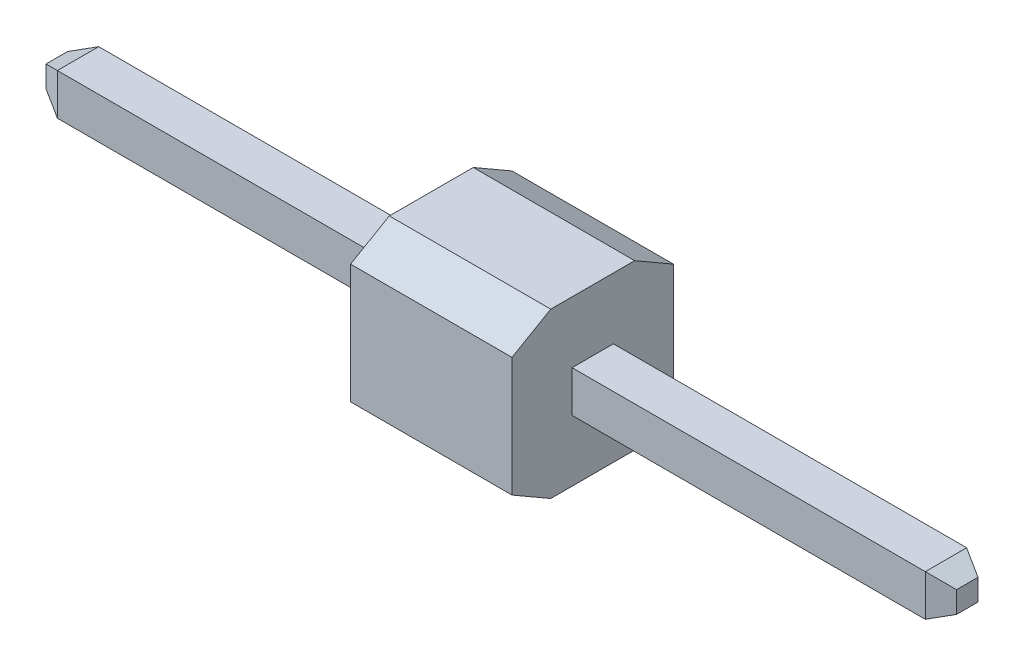
ISO-10303-21;
HEADER;
FILE_DESCRIPTION(('STEP AP214'),'2;1');
FILE_NAME('part.step','',(''),(''),'','','');
FILE_SCHEMA(('AUTOMOTIVE_DESIGN { 1 0 10303 214 1 1 1 1 }'));
ENDSEC;
DATA;
#1=APPLICATION_CONTEXT('core data for automotive mechanical design processes');
#2=APPLICATION_PROTOCOL_DEFINITION('international standard','automotive_design',2000,#1);
#3=PRODUCT_CONTEXT('',#1,'mechanical');
#4=PRODUCT('Part','Part','',(#3));
#5=PRODUCT_RELATED_PRODUCT_CATEGORY('part','',(#4));
#6=PRODUCT_DEFINITION_FORMATION('','',#4);
#7=PRODUCT_DEFINITION_CONTEXT('part definition',#1,'design');
#8=PRODUCT_DEFINITION('design','',#6,#7);
#9=PRODUCT_DEFINITION_SHAPE('','',#8);
#10=(LENGTH_UNIT() NAMED_UNIT(*) SI_UNIT(.MILLI.,.METRE.));
#11=(NAMED_UNIT(*) PLANE_ANGLE_UNIT() SI_UNIT($,.RADIAN.));
#12=(NAMED_UNIT(*) SI_UNIT($,.STERADIAN.) SOLID_ANGLE_UNIT());
#13=UNCERTAINTY_MEASURE_WITH_UNIT(LENGTH_MEASURE(1.E-05),#10,'distance_accuracy_value','');
#14=(GEOMETRIC_REPRESENTATION_CONTEXT(3) GLOBAL_UNCERTAINTY_ASSIGNED_CONTEXT((#13)) GLOBAL_UNIT_ASSIGNED_CONTEXT((#10,
#11,#12)) REPRESENTATION_CONTEXT('',''));
#15=CARTESIAN_POINT('',(0.,0.,0.));
#16=DIRECTION('',(0.,0.,1.));
#17=DIRECTION('',(1.,0.,0.));
#18=AXIS2_PLACEMENT_3D('',#15,#16,#17);
#19=CARTESIAN_POINT('',(5.42107561170757,-15.5571215871937,0.629998634255617));
#20=DIRECTION('',(1.,4.37113882867379E-08,-4.37113882867379E-08));
#21=DIRECTION('',(-4.37113882867379E-08,1.,0.));
#22=AXIS2_PLACEMENT_3D('',#19,#20,#21);
#23=PLANE('',#22);
#24=DIRECTION('',(1.59994777304464E-08,0.500000000000191,0.866025403784328));
#25=VECTOR('',#24,1.);
#26=CARTESIAN_POINT('',(5.42107548872165,-14.3135317487037,-0.940001365744382));
#27=LINE('',#26,#25);
#28=CARTESIAN_POINT('',(5.42107548872165,-14.3135317487037,-0.940001365744382));
#29=VERTEX_POINT('',#28);
#30=CARTESIAN_POINT('',(5.42107549980641,-13.9671215871937,-0.340001365744383));
#31=VERTEX_POINT('',#30);
#32=EDGE_CURVE('E11',#29,#31,#27,.T.);
#33=ORIENTED_EDGE('',*,*,#32,.T.);
#34=DIRECTION('',(4.37113880134522E-08,0.,0.999999999999999));
#35=VECTOR('',#34,1.);
#36=CARTESIAN_POINT('',(5.42107549980641,-13.9671215871937,-0.340001365744383));
#37=LINE('',#36,#35);
#38=CARTESIAN_POINT('',(5.42107555663122,-13.9671215871937,0.959998634255618));
#39=VERTEX_POINT('',#38);
#40=EDGE_CURVE('E304',#31,#39,#37,.T.);
#41=ORIENTED_EDGE('',*,*,#40,.T.);
#42=DIRECTION('',(5.97108681645513E-08,-0.500000000000186,0.866025403784329));
#43=VECTOR('',#42,1.);
#44=CARTESIAN_POINT('',(5.42107555663122,-13.9671215871937,0.959998634255618));
#45=LINE('',#44,#43);
#46=CARTESIAN_POINT('',(5.42107559800012,-14.3135317487037,1.55999863425562));
#47=VERTEX_POINT('',#46);
#48=EDGE_CURVE('E296',#39,#47,#45,.T.);
#49=ORIENTED_EDGE('',*,*,#48,.T.);
#50=DIRECTION('',(4.37113880007249E-08,-0.999999999999999,0.));
#51=VECTOR('',#50,1.);
#52=CARTESIAN_POINT('',(5.42107559800012,-14.3135317487037,1.55999863425562));
#53=LINE('',#52,#51);
#54=CARTESIAN_POINT('',(5.42107567874291,-16.1607114256737,1.55999863425562));
#55=VERTEX_POINT('',#54);
#56=EDGE_CURVE('E281',#47,#55,#53,.T.);
#57=ORIENTED_EDGE('',*,*,#56,.T.);
#58=DIRECTION('',(1.59994790123059E-08,0.500000000000195,0.866025403784326));
#59=VECTOR('',#58,1.);
#60=CARTESIAN_POINT('',(5.42107566765814,-16.5071215871937,0.959998634255618));
#61=LINE('',#60,#59);
#62=CARTESIAN_POINT('',(5.42107566765814,-16.5071215871937,0.959998634255618));
#63=VERTEX_POINT('',#62);
#64=EDGE_CURVE('E265',#63,#55,#61,.T.);
#65=ORIENTED_EDGE('',*,*,#64,.F.);
#66=DIRECTION('',(4.37113880134522E-08,0.,0.999999999999999));
#67=VECTOR('',#66,1.);
#68=CARTESIAN_POINT('',(5.42107561083334,-16.5071215871937,-0.340001365744383));
#69=LINE('',#68,#67);
#70=CARTESIAN_POINT('',(5.42107561083334,-16.5071215871937,-0.340001365744383));
#71=VERTEX_POINT('',#70);
#72=EDGE_CURVE('E248',#71,#63,#69,.T.);
#73=ORIENTED_EDGE('',*,*,#72,.F.);
#74=DIRECTION('',(5.97108668821451E-08,-0.500000000000186,0.866025403784329));
#75=VECTOR('',#74,1.);
#76=CARTESIAN_POINT('',(5.42107556946444,-16.1607114256737,-0.940001365744382));
#77=LINE('',#76,#75);
#78=CARTESIAN_POINT('',(5.42107556946444,-16.1607114256737,-0.940001365744382));
#79=VERTEX_POINT('',#78);
#80=EDGE_CURVE('E242',#79,#71,#77,.T.);
#81=ORIENTED_EDGE('',*,*,#80,.F.);
#82=DIRECTION('',(4.37113880007249E-08,-0.999999999999999,0.));
#83=VECTOR('',#82,1.);
#84=CARTESIAN_POINT('',(5.42107548872165,-14.3135317487037,-0.940001365744382));
#85=LINE('',#84,#83);
#86=EDGE_CURVE('E236',#29,#79,#85,.T.);
#87=ORIENTED_EDGE('',*,*,#86,.F.);
#88=EDGE_LOOP('',(#33,#41,#49,#57,#65,#73,#81,#87));
#89=FACE_BOUND('',#88,.T.);
#90=DIRECTION('',(-4.37113872875372E-08,0.,-0.999999999999999));
#91=VECTOR('',#90,1.);
#92=CARTESIAN_POINT('',(5.42107558373228,-14.9171215871937,0.629998634255617));
#93=LINE('',#92,#91);
#94=CARTESIAN_POINT('',(5.42107558373228,-14.9171215871937,0.629998634255617));
#95=VERTEX_POINT('',#94);
#96=CARTESIAN_POINT('',(5.42107555575699,-14.9171215871937,-0.0100013657443826));
#97=VERTEX_POINT('',#96);
#98=EDGE_CURVE('E302',#95,#97,#93,.T.);
#99=ORIENTED_EDGE('',*,*,#98,.T.);
#100=DIRECTION('',(-4.37113872875371E-08,0.999999999999999,0.));
#101=VECTOR('',#100,1.);
#102=CARTESIAN_POINT('',(5.42107558373228,-15.5571215871937,-0.0100013657443826));
#103=LINE('',#102,#101);
#104=CARTESIAN_POINT('',(5.42107558373228,-15.5571215871937,-0.0100013657443826));
#105=VERTEX_POINT('',#104);
#106=EDGE_CURVE('E293',#105,#97,#103,.T.);
#107=ORIENTED_EDGE('',*,*,#106,.F.);
#108=DIRECTION('',(-4.37113886753159E-08,0.,-0.999999999999999));
#109=VECTOR('',#108,1.);
#110=CARTESIAN_POINT('',(5.42107561170757,-15.5571215871937,0.629998634255617));
#111=LINE('',#110,#109);
#112=CARTESIAN_POINT('',(5.42107561170757,-15.5571215871937,0.629998634255617));
#113=VERTEX_POINT('',#112);
#114=EDGE_CURVE('E278',#113,#105,#111,.T.);
#115=ORIENTED_EDGE('',*,*,#114,.F.);
#116=DIRECTION('',(-4.37113886753159E-08,0.999999999999999,0.));
#117=VECTOR('',#116,1.);
#118=CARTESIAN_POINT('',(5.42107561170757,-15.5571215871937,0.629998634255617));
#119=LINE('',#118,#117);
#120=EDGE_CURVE('E263',#113,#95,#119,.T.);
#121=ORIENTED_EDGE('',*,*,#120,.T.);
#122=EDGE_LOOP('',(#99,#107,#115,#121));
#123=FACE_BOUND('',#122,.T.);
#124=ADVANCED_FACE('F17',(#89,#123),#23,.T.);
#125=CARTESIAN_POINT('',(2.92107561170757,-15.5571216964722,0.629998743534088));
#126=DIRECTION('',(1.,4.37113882867379E-08,-4.37113882867379E-08));
#127=DIRECTION('',(-4.37113882867379E-08,1.,0.));
#128=AXIS2_PLACEMENT_3D('',#125,#126,#127);
#129=PLANE('',#128);
#130=DIRECTION('',(1.59994783714339E-08,0.500000000000191,0.866025403784328));
#131=VECTOR('',#130,1.);
#132=CARTESIAN_POINT('',(2.92107548872165,-14.3135318579822,-0.940001256465912));
#133=LINE('',#132,#131);
#134=CARTESIAN_POINT('',(2.92107548872165,-14.3135318579822,-0.940001256465912));
#135=VERTEX_POINT('',#134);
#136=CARTESIAN_POINT('',(2.92107549980641,-13.9671216964722,-0.340001256465912));
#137=VERTEX_POINT('',#136);
#138=EDGE_CURVE('E24',#135,#137,#133,.T.);
#139=ORIENTED_EDGE('',*,*,#138,.F.);
#140=DIRECTION('',(4.37113882411396E-08,-0.999999999999999,0.));
#141=VECTOR('',#140,1.);
#142=CARTESIAN_POINT('',(2.92107548872165,-14.3135318579822,-0.940001256465912));
#143=LINE('',#142,#141);
#144=CARTESIAN_POINT('',(2.92107556946444,-16.1607115349522,-0.940001256465912));
#145=VERTEX_POINT('',#144);
#146=EDGE_CURVE('E300',#135,#145,#143,.T.);
#147=ORIENTED_EDGE('',*,*,#146,.T.);
#148=DIRECTION('',(5.97108668821451E-08,-0.500000000000186,0.866025403784329));
#149=VECTOR('',#148,1.);
#150=CARTESIAN_POINT('',(2.92107556946444,-16.1607115349522,-0.940001256465912));
#151=LINE('',#150,#149);
#152=CARTESIAN_POINT('',(2.92107561083334,-16.5071216964722,-0.340001256465912));
#153=VERTEX_POINT('',#152);
#154=EDGE_CURVE('E286',#145,#153,#151,.T.);
#155=ORIENTED_EDGE('',*,*,#154,.T.);
#156=DIRECTION('',(4.37113883550593E-08,0.,0.999999999999999));
#157=VECTOR('',#156,1.);
#158=CARTESIAN_POINT('',(2.92107561083334,-16.5071216964722,-0.340001256465912));
#159=LINE('',#158,#157);
#160=CARTESIAN_POINT('',(2.92107566765814,-16.5071216964722,0.959998743534088));
#161=VERTEX_POINT('',#160);
#162=EDGE_CURVE('E271',#153,#161,#159,.T.);
#163=ORIENTED_EDGE('',*,*,#162,.T.);
#164=DIRECTION('',(1.59994783713184E-08,0.500000000000195,0.866025403784326));
#165=VECTOR('',#164,1.);
#166=CARTESIAN_POINT('',(2.92107566765814,-16.5071216964722,0.959998743534088));
#167=LINE('',#166,#165);
#168=CARTESIAN_POINT('',(2.92107567874291,-16.1607115349522,1.55999874353409));
#169=VERTEX_POINT('',#168);
#170=EDGE_CURVE('E253',#161,#169,#167,.T.);
#171=ORIENTED_EDGE('',*,*,#170,.T.);
#172=DIRECTION('',(4.37113882411396E-08,-0.999999999999999,0.));
#173=VECTOR('',#172,1.);
#174=CARTESIAN_POINT('',(2.92107559800012,-14.3135318579822,1.55999874353409));
#175=LINE('',#174,#173);
#176=CARTESIAN_POINT('',(2.92107559800012,-14.3135318579822,1.55999874353409));
#177=VERTEX_POINT('',#176);
#178=EDGE_CURVE('E261',#177,#169,#175,.T.);
#179=ORIENTED_EDGE('',*,*,#178,.F.);
#180=DIRECTION('',(5.97108668825762E-08,-0.500000000000186,0.866025403784329));
#181=VECTOR('',#180,1.);
#182=CARTESIAN_POINT('',(2.92107555663122,-13.9671216964722,0.959998743534088));
#183=LINE('',#182,#181);
#184=CARTESIAN_POINT('',(2.92107555663122,-13.9671216964722,0.959998743534088));
#185=VERTEX_POINT('',#184);
#186=EDGE_CURVE('E276',#185,#177,#183,.T.);
#187=ORIENTED_EDGE('',*,*,#186,.F.);
#188=DIRECTION('',(4.37113883550593E-08,0.,0.999999999999999));
#189=VECTOR('',#188,1.);
#190=CARTESIAN_POINT('',(2.92107549980641,-13.9671216964722,-0.340001256465912));
#191=LINE('',#190,#189);
#192=EDGE_CURVE('E291',#137,#185,#191,.T.);
#193=ORIENTED_EDGE('',*,*,#192,.F.);
#194=EDGE_LOOP('',(#139,#147,#155,#163,#171,#179,#187,#193));
#195=FACE_BOUND('',#194,.T.);
#196=DIRECTION('',(-4.37113886753159E-08,0.999999999999999,0.));
#197=VECTOR('',#196,1.);
#198=CARTESIAN_POINT('',(2.92107558373228,-15.5571216964722,-0.0100012564659119));
#199=LINE('',#198,#197);
#200=CARTESIAN_POINT('',(2.92107558373228,-15.5571216964722,-0.0100012564659119));
#201=VERTEX_POINT('',#200);
#202=CARTESIAN_POINT('',(2.92107555575699,-14.9171216964722,-0.0100012564659119));
#203=VERTEX_POINT('',#202);
#204=EDGE_CURVE('E298',#201,#203,#199,.T.);
#205=ORIENTED_EDGE('',*,*,#204,.T.);
#206=DIRECTION('',(-4.37113886753159E-08,0.,-0.999999999999999));
#207=VECTOR('',#206,1.);
#208=CARTESIAN_POINT('',(2.92107558373228,-14.9171216964722,0.629998743534088));
#209=LINE('',#208,#207);
#210=CARTESIAN_POINT('',(2.92107558373228,-14.9171216964722,0.629998743534088));
#211=VERTEX_POINT('',#210);
#212=EDGE_CURVE('E283',#211,#203,#209,.T.);
#213=ORIENTED_EDGE('',*,*,#212,.F.);
#214=DIRECTION('',(-4.37113879814265E-08,0.999999999999999,0.));
#215=VECTOR('',#214,1.);
#216=CARTESIAN_POINT('',(2.92107561170757,-15.5571216964722,0.629998743534088));
#217=LINE('',#216,#215);
#218=CARTESIAN_POINT('',(2.92107561170757,-15.5571216964722,0.629998743534088));
#219=VERTEX_POINT('',#218);
#220=EDGE_CURVE('E268',#219,#211,#217,.T.);
#221=ORIENTED_EDGE('',*,*,#220,.F.);
#222=DIRECTION('',(-4.37113879814266E-08,0.,-0.999999999999999));
#223=VECTOR('',#222,1.);
#224=CARTESIAN_POINT('',(2.92107561170757,-15.5571216964722,0.629998743534088));
#225=LINE('',#224,#223);
#226=EDGE_CURVE('E251',#219,#201,#225,.T.);
#227=ORIENTED_EDGE('',*,*,#226,.T.);
#228=EDGE_LOOP('',(#205,#213,#221,#227));
#229=FACE_BOUND('',#228,.T.);
#230=ADVANCED_FACE('F314',(#195,#229),#129,.F.);
#231=CARTESIAN_POINT('',(5.42107548872165,-14.3135317487037,-0.940001365744382));
#232=DIRECTION('',(5.97108668343731E-08,-0.866025403784328,0.50000000000019));
#233=DIRECTION('',(-1.59994785476185E-08,-0.500000000000192,-0.866025403784329));
#234=AXIS2_PLACEMENT_3D('',#231,#232,#233);
#235=PLANE('',#234);
#236=ORIENTED_EDGE('',*,*,#138,.T.);
#237=DIRECTION('',(-0.999999999999998,-4.37113854445669E-08,4.37113883755557E-08));
#238=VECTOR('',#237,1.);
#239=CARTESIAN_POINT('',(5.42107549980641,-13.9671215871937,-0.340001365744383));
#240=LINE('',#239,#238);
#241=EDGE_CURVE('E288',#31,#137,#240,.T.);
#242=ORIENTED_EDGE('',*,*,#241,.F.);
#243=ORIENTED_EDGE('',*,*,#32,.F.);
#244=DIRECTION('',(-0.999999999999998,-4.37113897078233E-08,4.37113881091021E-08));
#245=VECTOR('',#244,1.);
#246=CARTESIAN_POINT('',(5.42107548872165,-14.3135317487037,-0.940001365744382));
#247=LINE('',#246,#245);
#248=EDGE_CURVE('E256',#29,#135,#247,.T.);
#249=ORIENTED_EDGE('',*,*,#248,.T.);
#250=EDGE_LOOP('',(#236,#242,#243,#249));
#251=FACE_BOUND('',#250,.T.);
#252=ADVANCED_FACE('F306',(#251),#235,.F.);
#253=CARTESIAN_POINT('',(5.42107549980641,-13.9671215871937,-0.340001365744383));
#254=DIRECTION('',(4.37113882867379E-08,-1.,0.));
#255=DIRECTION('',(1.,4.37113882867379E-08,-4.37113882867379E-08));
#256=AXIS2_PLACEMENT_3D('',#253,#254,#255);
#257=PLANE('',#256);
#258=ORIENTED_EDGE('',*,*,#192,.T.);
#259=DIRECTION('',(-0.999999999999998,-4.37113854445669E-08,4.37113882867378E-08));
#260=VECTOR('',#259,1.);
#261=CARTESIAN_POINT('',(5.42107555663122,-13.9671215871937,0.959998634255618));
#262=LINE('',#261,#260);
#263=EDGE_CURVE('E273',#39,#185,#262,.T.);
#264=ORIENTED_EDGE('',*,*,#263,.F.);
#265=ORIENTED_EDGE('',*,*,#40,.F.);
#266=ORIENTED_EDGE('',*,*,#241,.T.);
#267=EDGE_LOOP('',(#258,#264,#265,#266));
#268=FACE_BOUND('',#267,.T.);
#269=ADVANCED_FACE('F311',(#268),#257,.F.);
#270=CARTESIAN_POINT('',(5.42107555663122,-13.9671215871937,0.959998634255618));
#271=DIRECTION('',(1.59994785476185E-08,-0.86602540378433,-0.50000000000019));
#272=DIRECTION('',(-5.97108668343731E-08,0.500000000000188,-0.866025403784329));
#273=AXIS2_PLACEMENT_3D('',#270,#271,#272);
#274=PLANE('',#273);
#275=ORIENTED_EDGE('',*,*,#186,.T.);
#276=DIRECTION('',(-0.999999999999998,-4.37113897078233E-08,4.37113882867378E-08));
#277=VECTOR('',#276,1.);
#278=CARTESIAN_POINT('',(5.42107559800012,-14.3135317487037,1.55999863425562));
#279=LINE('',#278,#277);
#280=EDGE_CURVE('E258',#47,#177,#279,.T.);
#281=ORIENTED_EDGE('',*,*,#280,.F.);
#282=ORIENTED_EDGE('',*,*,#48,.F.);
#283=ORIENTED_EDGE('',*,*,#263,.T.);
#284=EDGE_LOOP('',(#275,#281,#282,#283));
#285=FACE_BOUND('',#284,.T.);
#286=ADVANCED_FACE('F319',(#285),#274,.F.);
#287=CARTESIAN_POINT('',(5.42107559800012,-14.3135317487037,1.55999863425562));
#288=DIRECTION('',(-4.37113882867379E-08,0.,-1.));
#289=DIRECTION('',(-1.,-4.37113882867379E-08,4.37113882867379E-08));
#290=AXIS2_PLACEMENT_3D('',#287,#288,#289);
#291=PLANE('',#290);
#292=ORIENTED_EDGE('',*,*,#178,.T.);
#293=DIRECTION('',(-0.999999999999998,-4.37113897078233E-08,4.37113882867378E-08));
#294=VECTOR('',#293,1.);
#295=CARTESIAN_POINT('',(5.42107567874291,-16.1607114256737,1.55999863425562));
#296=LINE('',#295,#294);
#297=EDGE_CURVE('E245',#55,#169,#296,.T.);
#298=ORIENTED_EDGE('',*,*,#297,.F.);
#299=ORIENTED_EDGE('',*,*,#56,.F.);
#300=ORIENTED_EDGE('',*,*,#280,.T.);
#301=EDGE_LOOP('',(#292,#298,#299,#300));
#302=FACE_BOUND('',#301,.T.);
#303=ADVANCED_FACE('F326',(#302),#291,.F.);
#304=CARTESIAN_POINT('',(5.42107566765814,-16.5071215871937,0.959998634255618));
#305=DIRECTION('',(5.97108668343731E-08,-0.866025403784328,0.50000000000019));
#306=DIRECTION('',(-1.59994785476185E-08,-0.500000000000192,-0.866025403784329));
#307=AXIS2_PLACEMENT_3D('',#304,#305,#306);
#308=PLANE('',#307);
#309=ORIENTED_EDGE('',*,*,#170,.F.);
#310=DIRECTION('',(-0.999999999999998,-4.37113854445669E-08,4.37113882867378E-08));
#311=VECTOR('',#310,1.);
#312=CARTESIAN_POINT('',(5.42107566765814,-16.5071215871937,0.959998634255618));
#313=LINE('',#312,#311);
#314=EDGE_CURVE('E239',#63,#161,#313,.T.);
#315=ORIENTED_EDGE('',*,*,#314,.F.);
#316=ORIENTED_EDGE('',*,*,#64,.T.);
#317=ORIENTED_EDGE('',*,*,#297,.T.);
#318=EDGE_LOOP('',(#309,#315,#316,#317));
#319=FACE_BOUND('',#318,.T.);
#320=ADVANCED_FACE('F329',(#319),#308,.T.);
#321=CARTESIAN_POINT('',(5.42107561083334,-16.5071215871937,-0.340001365744383));
#322=DIRECTION('',(4.37113882867379E-08,-1.,0.));
#323=DIRECTION('',(1.,4.37113882867379E-08,-4.37113882867379E-08));
#324=AXIS2_PLACEMENT_3D('',#321,#322,#323);
#325=PLANE('',#324);
#326=ORIENTED_EDGE('',*,*,#162,.F.);
#327=DIRECTION('',(-0.999999999999998,-4.37113854445669E-08,4.37113883755557E-08));
#328=VECTOR('',#327,1.);
#329=CARTESIAN_POINT('',(5.42107561083334,-16.5071215871937,-0.340001365744383));
#330=LINE('',#329,#328);
#331=EDGE_CURVE('E233',#71,#153,#330,.T.);
#332=ORIENTED_EDGE('',*,*,#331,.F.);
#333=ORIENTED_EDGE('',*,*,#72,.T.);
#334=ORIENTED_EDGE('',*,*,#314,.T.);
#335=EDGE_LOOP('',(#326,#332,#333,#334));
#336=FACE_BOUND('',#335,.T.);
#337=ADVANCED_FACE('F333',(#336),#325,.T.);
#338=CARTESIAN_POINT('',(5.42107556946444,-16.1607114256737,-0.940001365744382));
#339=DIRECTION('',(1.59994785476185E-08,-0.86602540378433,-0.50000000000019));
#340=DIRECTION('',(-5.97108668343731E-08,0.500000000000188,-0.866025403784329));
#341=AXIS2_PLACEMENT_3D('',#338,#339,#340);
#342=PLANE('',#341);
#343=ORIENTED_EDGE('',*,*,#154,.F.);
#344=DIRECTION('',(-0.999999999999998,-4.37113897078233E-08,4.37113881091022E-08));
#345=VECTOR('',#344,1.);
#346=CARTESIAN_POINT('',(5.42107556946444,-16.1607114256737,-0.940001365744382));
#347=LINE('',#346,#345);
#348=EDGE_CURVE('E230',#79,#145,#347,.T.);
#349=ORIENTED_EDGE('',*,*,#348,.F.);
#350=ORIENTED_EDGE('',*,*,#80,.T.);
#351=ORIENTED_EDGE('',*,*,#331,.T.);
#352=EDGE_LOOP('',(#343,#349,#350,#351));
#353=FACE_BOUND('',#352,.T.);
#354=ADVANCED_FACE('F337',(#353),#342,.T.);
#355=CARTESIAN_POINT('',(5.42107548872165,-14.3135317487037,-0.940001365744382));
#356=DIRECTION('',(-4.37113882867379E-08,0.,-1.));
#357=DIRECTION('',(-4.37113882867379E-08,1.,0.));
#358=AXIS2_PLACEMENT_3D('',#355,#356,#357);
#359=PLANE('',#358);
#360=ORIENTED_EDGE('',*,*,#146,.F.);
#361=ORIENTED_EDGE('',*,*,#248,.F.);
#362=ORIENTED_EDGE('',*,*,#86,.T.);
#363=ORIENTED_EDGE('',*,*,#348,.T.);
#364=EDGE_LOOP('',(#360,#361,#362,#363));
#365=FACE_BOUND('',#364,.T.);
#366=ADVANCED_FACE('F339',(#365),#359,.T.);
#367=CARTESIAN_POINT('',(-2.87892438829243,-15.5571219499982,0.62999899706014));
#368=DIRECTION('',(-1.,-4.37113882867379E-08,4.37113882867379E-08));
#369=DIRECTION('',(4.37113882867379E-08,-1.,0.));
#370=AXIS2_PLACEMENT_3D('',#367,#368,#369);
#371=PLANE('',#370);
#372=DIRECTION('',(4.3711384729096E-08,-0.999999999999999,0.));
#373=VECTOR('',#372,1.);
#374=CARTESIAN_POINT('',(-2.87892443079026,-15.0710034771882,0.14388052425114));
#375=LINE('',#374,#373);
#376=CARTESIAN_POINT('',(-2.87892443079026,-15.0710034771882,0.14388052425114));
#377=VERTEX_POINT('',#376);
#378=CARTESIAN_POINT('',(-2.87892441626772,-15.4032404227982,0.14388052425114));
#379=VERTEX_POINT('',#378);
#380=EDGE_CURVE('E228',#377,#379,#375,.T.);
#381=ORIENTED_EDGE('',*,*,#380,.T.);
#382=DIRECTION('',(4.37113900746999E-08,0.,0.999999999999999));
#383=VECTOR('',#382,1.);
#384=CARTESIAN_POINT('',(-2.87892441626772,-15.4032404227982,0.14388052425114));
#385=LINE('',#384,#383);
#386=CARTESIAN_POINT('',(-2.87892440174518,-15.4032404227982,0.47611746986914));
#387=VERTEX_POINT('',#386);
#388=EDGE_CURVE('E223',#379,#387,#385,.T.);
#389=ORIENTED_EDGE('',*,*,#388,.T.);
#390=DIRECTION('',(-4.37113874024243E-08,0.999999999999999,0.));
#391=VECTOR('',#390,1.);
#392=CARTESIAN_POINT('',(-2.87892440174519,-15.4032404227982,0.47611746986914));
#393=LINE('',#392,#391);
#394=CARTESIAN_POINT('',(-2.87892441626772,-15.0710034771882,0.47611746986914));
#395=VERTEX_POINT('',#394);
#396=EDGE_CURVE('E215',#387,#395,#393,.T.);
#397=ORIENTED_EDGE('',*,*,#396,.T.);
#398=DIRECTION('',(-4.37113820547151E-08,0.,-0.999999999999999));
#399=VECTOR('',#398,1.);
#400=CARTESIAN_POINT('',(-2.87892441626772,-15.0710034771882,0.47611746986914));
#401=LINE('',#400,#399);
#402=EDGE_CURVE('E207',#395,#377,#401,.T.);
#403=ORIENTED_EDGE('',*,*,#402,.T.);
#404=EDGE_LOOP('',(#381,#389,#397,#403));
#405=FACE_BOUND('',#404,.T.);
#406=ADVANCED_FACE('F341',(#405),#371,.T.);
#407=CARTESIAN_POINT('',(-2.87892438829243,-15.5571219499982,0.62999899706014));
#408=DIRECTION('',(4.37113882867379E-08,-1.,0.));
#409=DIRECTION('',(-4.37113882867379E-08,0.,-1.));
#410=AXIS2_PLACEMENT_3D('',#407,#408,#409);
#411=PLANE('',#410);
#412=DIRECTION('',(0.999999999999998,4.37113888452998E-08,-4.37113882769955E-08));
#413=VECTOR('',#412,1.);
#414=CARTESIAN_POINT('',(-2.54892438829243,-15.5571219355735,0.629998982635382));
#415=LINE('',#414,#413);
#416=CARTESIAN_POINT('',(-2.54892438829243,-15.5571219355735,0.629998982635382));
#417=VERTEX_POINT('',#416);
#418=EDGE_CURVE('E225',#417,#219,#415,.T.);
#419=ORIENTED_EDGE('',*,*,#418,.F.);
#420=DIRECTION('',(-4.37113886753159E-08,0.,-0.999999999999999));
#421=VECTOR('',#420,1.);
#422=CARTESIAN_POINT('',(-2.54892438829243,-15.5571219355735,0.629998982635382));
#423=LINE('',#422,#421);
#424=CARTESIAN_POINT('',(-2.54892441626772,-15.5571219355735,-0.010001017364618));
#425=VERTEX_POINT('',#424);
#426=EDGE_CURVE('E217',#417,#425,#423,.T.);
#427=ORIENTED_EDGE('',*,*,#426,.T.);
#428=DIRECTION('',(0.999999999999998,4.37113888452998E-08,-4.37113882161057E-08));
#429=VECTOR('',#428,1.);
#430=CARTESIAN_POINT('',(-2.54892441626772,-15.5571219355735,-0.010001017364618));
#431=LINE('',#430,#429);
#432=EDGE_CURVE('E220',#425,#201,#431,.T.);
#433=ORIENTED_EDGE('',*,*,#432,.T.);
#434=ORIENTED_EDGE('',*,*,#226,.F.);
#435=EDGE_LOOP('',(#419,#427,#433,#434));
#436=FACE_BOUND('',#435,.T.);
#437=ADVANCED_FACE('F348',(#436),#411,.T.);
#438=CARTESIAN_POINT('',(-2.87892441626772,-15.5571219499982,-0.0100010029398598));
#439=DIRECTION('',(-4.37113882867379E-08,0.,-1.));
#440=DIRECTION('',(-1.,-4.37113882867379E-08,4.37113882867379E-08));
#441=AXIS2_PLACEMENT_3D('',#438,#439,#440);
#442=PLANE('',#441);
#443=ORIENTED_EDGE('',*,*,#432,.F.);
#444=DIRECTION('',(-4.37113872875371E-08,0.999999999999999,0.));
#445=VECTOR('',#444,1.);
#446=CARTESIAN_POINT('',(-2.54892441626772,-15.5571219355735,-0.010001017364618));
#447=LINE('',#446,#445);
#448=CARTESIAN_POINT('',(-2.54892444424301,-14.9171219355735,-0.010001017364618));
#449=VERTEX_POINT('',#448);
#450=EDGE_CURVE('E209',#425,#449,#447,.T.);
#451=ORIENTED_EDGE('',*,*,#450,.T.);
#452=DIRECTION('',(0.999999999999998,4.37113855978467E-08,-4.37113882161058E-08));
#453=VECTOR('',#452,1.);
#454=CARTESIAN_POINT('',(-2.54892444424301,-14.9171219355735,-0.010001017364618));
#455=LINE('',#454,#453);
#456=EDGE_CURVE('E212',#449,#203,#455,.T.);
#457=ORIENTED_EDGE('',*,*,#456,.T.);
#458=ORIENTED_EDGE('',*,*,#204,.F.);
#459=EDGE_LOOP('',(#443,#451,#457,#458));
#460=FACE_BOUND('',#459,.T.);
#461=ADVANCED_FACE('F424',(#460),#442,.T.);
#462=CARTESIAN_POINT('',(-2.87892441626772,-14.9171219499982,0.62999899706014));
#463=DIRECTION('',(4.37113882867379E-08,-1.,0.));
#464=DIRECTION('',(-4.37113882867379E-08,0.,-1.));
#465=AXIS2_PLACEMENT_3D('',#462,#463,#464);
#466=PLANE('',#465);
#467=ORIENTED_EDGE('',*,*,#456,.F.);
#468=DIRECTION('',(4.37113886753159E-08,0.,0.999999999999999));
#469=VECTOR('',#468,1.);
#470=CARTESIAN_POINT('',(-2.54892444424301,-14.9171219355735,-0.010001017364618));
#471=LINE('',#470,#469);
#472=CARTESIAN_POINT('',(-2.54892441626772,-14.9171219355735,0.629998982635382));
#473=VERTEX_POINT('',#472);
#474=EDGE_CURVE('E201',#449,#473,#471,.T.);
#475=ORIENTED_EDGE('',*,*,#474,.T.);
#476=DIRECTION('',(0.999999999999998,4.37113855978467E-08,-4.37113882769955E-08));
#477=VECTOR('',#476,1.);
#478=CARTESIAN_POINT('',(-2.54892441626772,-14.9171219355735,0.629998982635382));
#479=LINE('',#478,#477);
#480=EDGE_CURVE('E204',#473,#211,#479,.T.);
#481=ORIENTED_EDGE('',*,*,#480,.T.);
#482=ORIENTED_EDGE('',*,*,#212,.T.);
#483=EDGE_LOOP('',(#467,#475,#481,#482));
#484=FACE_BOUND('',#483,.T.);
#485=ADVANCED_FACE('F421',(#484),#466,.F.);
#486=CARTESIAN_POINT('',(-2.87892438829243,-15.5571219499982,0.62999899706014));
#487=DIRECTION('',(-4.37113882867379E-08,0.,-1.));
#488=DIRECTION('',(-1.,-4.37113882867379E-08,4.37113882867379E-08));
#489=AXIS2_PLACEMENT_3D('',#486,#487,#488);
#490=PLANE('',#489);
#491=ORIENTED_EDGE('',*,*,#480,.F.);
#492=DIRECTION('',(4.37113872875371E-08,-0.999999999999999,0.));
#493=VECTOR('',#492,1.);
#494=CARTESIAN_POINT('',(-2.54892441626772,-14.9171219355735,0.629998982635382));
#495=LINE('',#494,#493);
#496=EDGE_CURVE('E196',#473,#417,#495,.T.);
#497=ORIENTED_EDGE('',*,*,#496,.T.);
#498=ORIENTED_EDGE('',*,*,#418,.T.);
#499=ORIENTED_EDGE('',*,*,#220,.T.);
#500=EDGE_LOOP('',(#491,#497,#498,#499));
#501=FACE_BOUND('',#500,.T.);
#502=ADVANCED_FACE('F376',(#501),#490,.F.);
#503=CARTESIAN_POINT('',(-2.87892438829243,-15.5571219499982,0.62999899706014));
#504=DIRECTION('',(-4.37113882867379E-08,0.,-1.));
#505=DIRECTION('',(-1.,-4.37113882867379E-08,4.37113882867379E-08));
#506=AXIS2_PLACEMENT_3D('',#503,#504,#505);
#507=PLANE('',#506);
#508=DIRECTION('',(0.999999999999998,4.37113829998842E-08,-4.37113882769955E-08));
#509=VECTOR('',#508,1.);
#510=CARTESIAN_POINT('',(5.42107561170757,-15.5571215871937,0.629998634255617));
#511=LINE('',#510,#509);
#512=CARTESIAN_POINT('',(10.8910756117076,-15.5571213480924,0.629998395154324));
#513=VERTEX_POINT('',#512);
#514=EDGE_CURVE('E199',#113,#513,#511,.T.);
#515=ORIENTED_EDGE('',*,*,#514,.T.);
#516=DIRECTION('',(-4.37113900630947E-08,0.999999999999999,0.));
#517=VECTOR('',#516,1.);
#518=CARTESIAN_POINT('',(10.8910756117076,-15.5571213480924,0.629998395154324));
#519=LINE('',#518,#517);
#520=CARTESIAN_POINT('',(10.8910755837323,-14.9171213480924,0.629998395154324));
#521=VERTEX_POINT('',#520);
#522=EDGE_CURVE('E191',#513,#521,#519,.T.);
#523=ORIENTED_EDGE('',*,*,#522,.T.);
#524=DIRECTION('',(0.999999999999998,4.37113881958092E-08,-4.37113882769955E-08));
#525=VECTOR('',#524,1.);
#526=CARTESIAN_POINT('',(5.42107558373228,-14.9171215871937,0.629998634255617));
#527=LINE('',#526,#525);
#528=EDGE_CURVE('E194',#95,#521,#527,.T.);
#529=ORIENTED_EDGE('',*,*,#528,.F.);
#530=ORIENTED_EDGE('',*,*,#120,.F.);
#531=EDGE_LOOP('',(#515,#523,#529,#530));
#532=FACE_BOUND('',#531,.T.);
#533=ADVANCED_FACE('F367',(#532),#507,.F.);
#534=CARTESIAN_POINT('',(-2.87892441626772,-14.9171219499982,0.62999899706014));
#535=DIRECTION('',(4.37113882867379E-08,-1.,0.));
#536=DIRECTION('',(-4.37113882867379E-08,0.,-1.));
#537=AXIS2_PLACEMENT_3D('',#534,#535,#536);
#538=PLANE('',#537);
#539=ORIENTED_EDGE('',*,*,#528,.T.);
#540=DIRECTION('',(-4.37113900630947E-08,0.,-0.999999999999999));
#541=VECTOR('',#540,1.);
#542=CARTESIAN_POINT('',(10.8910755837323,-14.9171213480924,0.629998395154324));
#543=LINE('',#542,#541);
#544=CARTESIAN_POINT('',(10.891075555757,-14.9171213480924,-0.0100016048456765));
#545=VERTEX_POINT('',#544);
#546=EDGE_CURVE('E186',#521,#545,#543,.T.);
#547=ORIENTED_EDGE('',*,*,#546,.T.);
#548=DIRECTION('',(0.999999999999998,4.37113881958092E-08,-4.37113881146228E-08));
#549=VECTOR('',#548,1.);
#550=CARTESIAN_POINT('',(5.42107555575699,-14.9171215871937,-0.0100013657443823));
#551=LINE('',#550,#549);
#552=EDGE_CURVE('E189',#97,#545,#551,.T.);
#553=ORIENTED_EDGE('',*,*,#552,.F.);
#554=ORIENTED_EDGE('',*,*,#98,.F.);
#555=EDGE_LOOP('',(#539,#547,#553,#554));
#556=FACE_BOUND('',#555,.T.);
#557=ADVANCED_FACE('F364',(#556),#538,.F.);
#558=CARTESIAN_POINT('',(-2.87892441626772,-15.5571219499982,-0.0100010029398598));
#559=DIRECTION('',(-4.37113882867379E-08,0.,-1.));
#560=DIRECTION('',(-1.,-4.37113882867379E-08,4.37113882867379E-08));
#561=AXIS2_PLACEMENT_3D('',#558,#559,#560);
#562=PLANE('',#561);
#563=ORIENTED_EDGE('',*,*,#552,.T.);
#564=DIRECTION('',(4.37113900630947E-08,-0.999999999999999,0.));
#565=VECTOR('',#564,1.);
#566=CARTESIAN_POINT('',(10.891075555757,-14.9171213480924,-0.0100016048456764));
#567=LINE('',#566,#565);
#568=CARTESIAN_POINT('',(10.8910755837323,-15.5571213480924,-0.0100016048456765));
#569=VERTEX_POINT('',#568);
#570=EDGE_CURVE('E176',#545,#569,#567,.T.);
#571=ORIENTED_EDGE('',*,*,#570,.T.);
#572=DIRECTION('',(0.999999999999998,4.37113829998842E-08,-4.37113881146228E-08));
#573=VECTOR('',#572,1.);
#574=CARTESIAN_POINT('',(5.42107558373228,-15.5571215871937,-0.0100013657443823));
#575=LINE('',#574,#573);
#576=EDGE_CURVE('E179',#105,#569,#575,.T.);
#577=ORIENTED_EDGE('',*,*,#576,.F.);
#578=ORIENTED_EDGE('',*,*,#106,.T.);
#579=EDGE_LOOP('',(#563,#571,#577,#578));
#580=FACE_BOUND('',#579,.T.);
#581=ADVANCED_FACE('F366',(#580),#562,.T.);
#582=CARTESIAN_POINT('',(-2.87892438829243,-15.5571219499982,0.62999899706014));
#583=DIRECTION('',(4.37113882867379E-08,-1.,0.));
#584=DIRECTION('',(-4.37113882867379E-08,0.,-1.));
#585=AXIS2_PLACEMENT_3D('',#582,#583,#584);
#586=PLANE('',#585);
#587=ORIENTED_EDGE('',*,*,#576,.T.);
#588=DIRECTION('',(4.37113872875372E-08,0.,0.999999999999999));
#589=VECTOR('',#588,1.);
#590=CARTESIAN_POINT('',(10.8910755837323,-15.5571213480924,-0.0100016048456765));
#591=LINE('',#590,#589);
#592=EDGE_CURVE('E167',#569,#513,#591,.T.);
#593=ORIENTED_EDGE('',*,*,#592,.T.);
#594=ORIENTED_EDGE('',*,*,#514,.F.);
#595=ORIENTED_EDGE('',*,*,#114,.T.);
#596=EDGE_LOOP('',(#587,#593,#594,#595));
#597=FACE_BOUND('',#596,.T.);
#598=ADVANCED_FACE('F373',(#597),#586,.T.);
#599=CARTESIAN_POINT('',(11.2210756117076,-15.5571213336676,0.629998380729565));
#600=DIRECTION('',(-1.,-4.37113882867379E-08,4.37113882867379E-08));
#601=DIRECTION('',(4.37113882867379E-08,-1.,0.));
#602=AXIS2_PLACEMENT_3D('',#599,#600,#601);
#603=PLANE('',#602);
#604=DIRECTION('',(-4.37113874024243E-08,0.999999999999999,0.));
#605=VECTOR('',#604,1.);
#606=CARTESIAN_POINT('',(11.2210755837323,-15.4032398064676,0.143879907920565));
#607=LINE('',#606,#605);
#608=CARTESIAN_POINT('',(11.2210755837323,-15.4032398064676,0.143879907920565));
#609=VERTEX_POINT('',#608);
#610=CARTESIAN_POINT('',(11.2210755692097,-15.0710028608576,0.143879907920565));
#611=VERTEX_POINT('',#610);
#612=EDGE_CURVE('E153',#609,#611,#607,.T.);
#613=ORIENTED_EDGE('',*,*,#612,.T.);
#614=DIRECTION('',(4.37113874013716E-08,0.,0.999999999999999));
#615=VECTOR('',#614,1.);
#616=CARTESIAN_POINT('',(11.2210755692097,-15.0710028608576,0.143879907920565));
#617=LINE('',#616,#615);
#618=CARTESIAN_POINT('',(11.2210755837323,-15.0710028608576,0.476116853538565));
#619=VERTEX_POINT('',#618);
#620=EDGE_CURVE('E395',#611,#619,#617,.T.);
#621=ORIENTED_EDGE('',*,*,#620,.T.);
#622=DIRECTION('',(4.37113874024243E-08,-0.999999999999999,0.));
#623=VECTOR('',#622,1.);
#624=CARTESIAN_POINT('',(11.2210755837323,-15.0710028608576,0.476116853538565));
#625=LINE('',#624,#623);
#626=CARTESIAN_POINT('',(11.2210755982548,-15.4032398064676,0.476116853538565));
#627=VERTEX_POINT('',#626);
#628=EDGE_CURVE('E156',#619,#627,#625,.T.);
#629=ORIENTED_EDGE('',*,*,#628,.T.);
#630=DIRECTION('',(-4.37113927480282E-08,0.,-0.999999999999999));
#631=VECTOR('',#630,1.);
#632=CARTESIAN_POINT('',(11.2210755982548,-15.4032398064676,0.476116853538565));
#633=LINE('',#632,#631);
#634=EDGE_CURVE('E149',#627,#609,#633,.T.);
#635=ORIENTED_EDGE('',*,*,#634,.T.);
#636=EDGE_LOOP('',(#613,#621,#629,#635));
#637=FACE_BOUND('',#636,.T.);
#638=ADVANCED_FACE('F151',(#637),#603,.F.);
#639=CARTESIAN_POINT('',(-2.87892440954135,-15.0710034771882,0.62999899706014));
#640=DIRECTION('',(-0.422618301356784,0.906307768563367,1.84732310895534E-08));
#641=DIRECTION('',(4.37113882867379E-08,0.,1.));
#642=AXIS2_PLACEMENT_3D('',#639,#640,#641);
#643=PLANE('',#642);
#644=DIRECTION('',(0.834817095446925,0.389281657126021,-0.389281657126018));
#645=VECTOR('',#644,1.);
#646=CARTESIAN_POINT('',(-2.87892443079028,-15.0710034771877,0.143880524251623));
#647=LINE('',#646,#645);
#648=EDGE_CURVE('E181',#377,#449,#647,.T.);
#649=ORIENTED_EDGE('',*,*,#648,.F.);
#650=ORIENTED_EDGE('',*,*,#402,.F.);
#651=DIRECTION('',(-0.834817129479006,-0.389281657126021,-0.389281584143986));
#652=VECTOR('',#651,1.);
#653=CARTESIAN_POINT('',(-2.54892441626815,-14.917121935572,0.629998982634844));
#654=LINE('',#653,#652);
#655=EDGE_CURVE('E404',#473,#395,#654,.T.);
#656=ORIENTED_EDGE('',*,*,#655,.F.);
#657=ORIENTED_EDGE('',*,*,#474,.F.);
#658=EDGE_LOOP('',(#649,#650,#656,#657));
#659=FACE_BOUND('',#658,.T.);
#660=ADVANCED_FACE('F418',(#659),#643,.T.);
#661=CARTESIAN_POINT('',(-2.87892439501881,-15.5571219499982,0.47611746986914));
#662=DIRECTION('',(-0.422618222124841,-1.84732292043498E-08,0.906307805509828));
#663=DIRECTION('',(4.37113882867379E-08,-1.,0.));
#664=AXIS2_PLACEMENT_3D('',#661,#662,#663);
#665=PLANE('',#664);
#666=ORIENTED_EDGE('',*,*,#655,.T.);
#667=ORIENTED_EDGE('',*,*,#396,.F.);
#668=DIRECTION('',(-0.834817163511093,0.389281584143969,-0.389281584143991));
#669=VECTOR('',#668,1.);
#670=CARTESIAN_POINT('',(-2.54892438829129,-15.5571219355707,0.629998982635654));
#671=LINE('',#670,#669);
#672=EDGE_CURVE('E160',#417,#387,#671,.T.);
#673=ORIENTED_EDGE('',*,*,#672,.F.);
#674=ORIENTED_EDGE('',*,*,#496,.F.);
#675=EDGE_LOOP('',(#666,#667,#673,#674));
#676=FACE_BOUND('',#675,.T.);
#677=ADVANCED_FACE('F434',(#676),#665,.T.);
#678=CARTESIAN_POINT('',(-2.54892441626772,-15.5571219355735,-0.010001017364618));
#679=DIRECTION('',(0.422618301356784,1.8473232667688E-08,0.906307768563367));
#680=DIRECTION('',(-4.37113882867379E-08,1.,0.));
#681=AXIS2_PLACEMENT_3D('',#678,#679,#680);
#682=PLANE('',#681);
#683=ORIENTED_EDGE('',*,*,#648,.T.);
#684=ORIENTED_EDGE('',*,*,#450,.F.);
#685=DIRECTION('',(0.83481712947901,-0.389281584143977,-0.389281657126021));
#686=VECTOR('',#685,1.);
#687=CARTESIAN_POINT('',(-2.87892441627056,-15.4032404228058,0.1438805242526));
#688=LINE('',#687,#686);
#689=EDGE_CURVE('E170',#379,#425,#688,.T.);
#690=ORIENTED_EDGE('',*,*,#689,.F.);
#691=ORIENTED_EDGE('',*,*,#380,.F.);
#692=EDGE_LOOP('',(#683,#684,#690,#691));
#693=FACE_BOUND('',#692,.T.);
#694=ADVANCED_FACE('F413',(#693),#682,.F.);
#695=CARTESIAN_POINT('',(-2.54892438829243,-15.5571219355735,0.629998982635382));
#696=DIRECTION('',(0.422618222124841,0.906307805509828,-1.84732308250282E-08));
#697=DIRECTION('',(-4.37113882867379E-08,0.,-1.));
#698=AXIS2_PLACEMENT_3D('',#695,#696,#697);
#699=PLANE('',#698);
#700=ORIENTED_EDGE('',*,*,#672,.T.);
#701=ORIENTED_EDGE('',*,*,#388,.F.);
#702=ORIENTED_EDGE('',*,*,#689,.T.);
#703=ORIENTED_EDGE('',*,*,#426,.F.);
#704=EDGE_LOOP('',(#700,#701,#702,#703));
#705=FACE_BOUND('',#704,.T.);
#706=ADVANCED_FACE('F429',(#705),#699,.F.);
#707=CARTESIAN_POINT('',(11.2210756049812,-15.4032398064676,0.629998380729565));
#708=DIRECTION('',(0.422618301356784,-0.906307768563367,-1.84732310470096E-08));
#709=DIRECTION('',(4.37113882867379E-08,0.,1.));
#710=AXIS2_PLACEMENT_3D('',#707,#708,#709);
#711=PLANE('',#710);
#712=DIRECTION('',(-0.834817129479002,-0.389281657126031,-0.389281584143985));
#713=VECTOR('',#712,1.);
#714=CARTESIAN_POINT('',(11.2210755837323,-15.4032398064682,0.143879907921048));
#715=LINE('',#714,#713);
#716=EDGE_CURVE('E164',#609,#569,#715,.T.);
#717=ORIENTED_EDGE('',*,*,#716,.F.);
#718=ORIENTED_EDGE('',*,*,#634,.F.);
#719=DIRECTION('',(0.834817095446926,0.389281657126017,-0.389281657126021));
#720=VECTOR('',#719,1.);
#721=CARTESIAN_POINT('',(10.8910756117076,-15.5571213480924,0.629998395154324));
#722=LINE('',#721,#720);
#723=EDGE_CURVE('E392',#513,#627,#722,.T.);
#724=ORIENTED_EDGE('',*,*,#723,.F.);
#725=ORIENTED_EDGE('',*,*,#592,.F.);
#726=EDGE_LOOP('',(#717,#718,#724,#725));
#727=FACE_BOUND('',#726,.T.);
#728=ADVANCED_FACE('F165',(#727),#711,.T.);
#729=CARTESIAN_POINT('',(10.8910756117076,-15.5571213480924,0.629998395154324));
#730=DIRECTION('',(-0.422618301356784,-1.8473232667688E-08,-0.906307768563367));
#731=DIRECTION('',(-4.37113882867379E-08,1.,0.));
#732=AXIS2_PLACEMENT_3D('',#729,#730,#731);
#733=PLANE('',#732);
#734=ORIENTED_EDGE('',*,*,#723,.T.);
#735=ORIENTED_EDGE('',*,*,#628,.F.);
#736=DIRECTION('',(0.834817129479008,-0.389281584143983,-0.389281657126021));
#737=VECTOR('',#736,1.);
#738=CARTESIAN_POINT('',(10.8910755837338,-14.9171213480882,0.629998395153421));
#739=LINE('',#738,#737);
#740=EDGE_CURVE('E389',#521,#619,#739,.T.);
#741=ORIENTED_EDGE('',*,*,#740,.F.);
#742=ORIENTED_EDGE('',*,*,#522,.F.);
#743=EDGE_LOOP('',(#734,#735,#741,#742));
#744=FACE_BOUND('',#743,.T.);
#745=ADVANCED_FACE('F390',(#744),#733,.F.);
#746=CARTESIAN_POINT('',(11.2210755904587,-15.5571213336676,0.143879907920565));
#747=DIRECTION('',(0.422618222124841,1.84732292043498E-08,-0.906307805509828));
#748=DIRECTION('',(4.37113882867379E-08,-1.,0.));
#749=AXIS2_PLACEMENT_3D('',#746,#747,#748);
#750=PLANE('',#749);
#751=ORIENTED_EDGE('',*,*,#716,.T.);
#752=ORIENTED_EDGE('',*,*,#570,.F.);
#753=DIRECTION('',(-0.834817163511088,0.389281584143981,-0.389281584143988));
#754=VECTOR('',#753,1.);
#755=CARTESIAN_POINT('',(11.2210755692098,-15.0710028608571,0.143879907921048));
#756=LINE('',#755,#754);
#757=EDGE_CURVE('E175',#611,#545,#756,.T.);
#758=ORIENTED_EDGE('',*,*,#757,.F.);
#759=ORIENTED_EDGE('',*,*,#612,.F.);
#760=EDGE_LOOP('',(#751,#752,#758,#759));
#761=FACE_BOUND('',#760,.T.);
#762=ADVANCED_FACE('F173',(#761),#750,.T.);
#763=CARTESIAN_POINT('',(10.8910755837323,-14.9171213480924,0.629998395154324));
#764=DIRECTION('',(-0.422618222124841,-0.906307805509828,1.84732307824844E-08));
#765=DIRECTION('',(-4.37113882867379E-08,0.,-1.));
#766=AXIS2_PLACEMENT_3D('',#763,#764,#765);
#767=PLANE('',#766);
#768=ORIENTED_EDGE('',*,*,#740,.T.);
#769=ORIENTED_EDGE('',*,*,#620,.F.);
#770=ORIENTED_EDGE('',*,*,#757,.T.);
#771=ORIENTED_EDGE('',*,*,#546,.F.);
#772=EDGE_LOOP('',(#768,#769,#770,#771));
#773=FACE_BOUND('',#772,.T.);
#774=ADVANCED_FACE('F394',(#773),#767,.F.);
#775=CLOSED_SHELL('',(#124,#230,#252,#269,#286,#303,#320,#337,#354,#366,#406,#437,#461,#485,
#502,#533,#557,#581,#598,#638,#660,#677,#694,#706,#728,#745,#762,#774));
#776=MANIFOLD_SOLID_BREP('B1',#775);
#777=ADVANCED_BREP_SHAPE_REPRESENTATION('',(#18,#776),#14);
#778=SHAPE_DEFINITION_REPRESENTATION(#9,#777);
ENDSEC;
END-ISO-10303-21;
